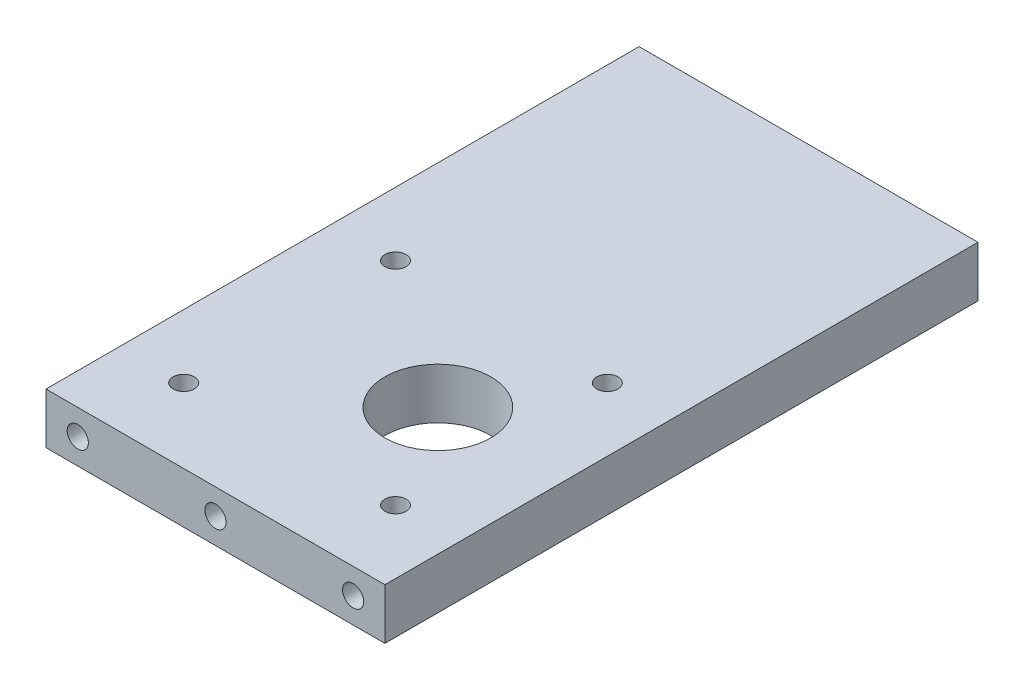
ISO-10303-21;
HEADER;
FILE_DESCRIPTION(('STEP AP214'),'2;1');
FILE_NAME('part.step','',(''),(''),'','','');
FILE_SCHEMA(('AUTOMOTIVE_DESIGN { 1 0 10303 214 1 1 1 1 }'));
ENDSEC;
DATA;
#1=APPLICATION_CONTEXT('core data for automotive mechanical design processes');
#2=APPLICATION_PROTOCOL_DEFINITION('international standard','automotive_design',2000,#1);
#3=PRODUCT_CONTEXT('',#1,'mechanical');
#4=PRODUCT('Part','Part','',(#3));
#5=PRODUCT_RELATED_PRODUCT_CATEGORY('part','',(#4));
#6=PRODUCT_DEFINITION_FORMATION('','',#4);
#7=PRODUCT_DEFINITION_CONTEXT('part definition',#1,'design');
#8=PRODUCT_DEFINITION('design','',#6,#7);
#9=PRODUCT_DEFINITION_SHAPE('','',#8);
#10=(LENGTH_UNIT() NAMED_UNIT(*) SI_UNIT(.MILLI.,.METRE.));
#11=(NAMED_UNIT(*) PLANE_ANGLE_UNIT() SI_UNIT($,.RADIAN.));
#12=(NAMED_UNIT(*) SI_UNIT($,.STERADIAN.) SOLID_ANGLE_UNIT());
#13=UNCERTAINTY_MEASURE_WITH_UNIT(LENGTH_MEASURE(1.E-05),#10,'distance_accuracy_value','');
#14=(GEOMETRIC_REPRESENTATION_CONTEXT(3) GLOBAL_UNCERTAINTY_ASSIGNED_CONTEXT((#13)) GLOBAL_UNIT_ASSIGNED_CONTEXT((#10,
#11,#12)) REPRESENTATION_CONTEXT('',''));
#15=CARTESIAN_POINT('',(0.,0.,0.));
#16=DIRECTION('',(0.,0.,1.));
#17=DIRECTION('',(1.,0.,0.));
#18=AXIS2_PLACEMENT_3D('',#15,#16,#17);
#19=CARTESIAN_POINT('',(0.,6.,0.));
#20=DIRECTION('',(0.,1.,0.));
#21=DIRECTION('',(0.,0.,1.));
#22=AXIS2_PLACEMENT_3D('',#19,#20,#21);
#23=PLANE('',#22);
#24=CARTESIAN_POINT('',(-25.,6.,-67.5));
#25=DIRECTION('',(0.,1.,0.));
#26=DIRECTION('',(0.,0.,1.));
#27=AXIS2_PLACEMENT_3D('',#24,#25,#26);
#28=CIRCLE('',#27,2.5);
#29=CARTESIAN_POINT('',(-25.,6.,-65.));
#30=VERTEX_POINT('',#29);
#31=EDGE_CURVE('E170',#30,#30,#28,.T.);
#32=ORIENTED_EDGE('',*,*,#31,.F.);
#33=EDGE_LOOP('',(#32));
#34=FACE_BOUND('',#33,.T.);
#35=CARTESIAN_POINT('',(25.,6.,-67.5));
#36=DIRECTION('',(0.,1.,0.));
#37=DIRECTION('',(0.,0.,1.));
#38=AXIS2_PLACEMENT_3D('',#35,#36,#37);
#39=CIRCLE('',#38,2.5);
#40=CARTESIAN_POINT('',(25.,6.,-65.));
#41=VERTEX_POINT('',#40);
#42=EDGE_CURVE('E176',#41,#41,#39,.T.);
#43=ORIENTED_EDGE('',*,*,#42,.F.);
#44=EDGE_LOOP('',(#43));
#45=FACE_BOUND('',#44,.T.);
#46=CARTESIAN_POINT('',(25.,6.,-17.5));
#47=DIRECTION('',(0.,1.,0.));
#48=DIRECTION('',(0.,0.,1.));
#49=AXIS2_PLACEMENT_3D('',#46,#47,#48);
#50=CIRCLE('',#49,2.5);
#51=CARTESIAN_POINT('',(25.,6.,-15.));
#52=VERTEX_POINT('',#51);
#53=EDGE_CURVE('E182',#52,#52,#50,.T.);
#54=ORIENTED_EDGE('',*,*,#53,.F.);
#55=EDGE_LOOP('',(#54));
#56=FACE_BOUND('',#55,.T.);
#57=CARTESIAN_POINT('',(-25.,6.,-17.5));
#58=DIRECTION('',(0.,1.,0.));
#59=DIRECTION('',(0.,0.,1.));
#60=AXIS2_PLACEMENT_3D('',#57,#58,#59);
#61=CIRCLE('',#60,2.5);
#62=CARTESIAN_POINT('',(-25.,6.,-15.));
#63=VERTEX_POINT('',#62);
#64=EDGE_CURVE('E188',#63,#63,#61,.T.);
#65=ORIENTED_EDGE('',*,*,#64,.F.);
#66=EDGE_LOOP('',(#65));
#67=FACE_BOUND('',#66,.T.);
#68=DIRECTION('',(0.,0.,1.));
#69=VECTOR('',#68,1.);
#70=CARTESIAN_POINT('',(-40.,6.,-140.));
#71=LINE('',#70,#69);
#72=CARTESIAN_POINT('',(-40.,6.,-140.));
#73=VERTEX_POINT('',#72);
#74=CARTESIAN_POINT('',(-40.,6.,0.));
#75=VERTEX_POINT('',#74);
#76=EDGE_CURVE('E201',#73,#75,#71,.T.);
#77=ORIENTED_EDGE('',*,*,#76,.T.);
#78=DIRECTION('',(1.,0.,0.));
#79=VECTOR('',#78,1.);
#80=CARTESIAN_POINT('',(-40.,6.,0.));
#81=LINE('',#80,#79);
#82=CARTESIAN_POINT('',(40.,6.,0.));
#83=VERTEX_POINT('',#82);
#84=EDGE_CURVE('E88',#75,#83,#81,.T.);
#85=ORIENTED_EDGE('',*,*,#84,.T.);
#86=DIRECTION('',(0.,0.,-1.));
#87=VECTOR('',#86,1.);
#88=CARTESIAN_POINT('',(40.,6.,-140.));
#89=LINE('',#88,#87);
#90=CARTESIAN_POINT('',(40.,6.,-140.));
#91=VERTEX_POINT('',#90);
#92=EDGE_CURVE('E204',#83,#91,#89,.T.);
#93=ORIENTED_EDGE('',*,*,#92,.T.);
#94=DIRECTION('',(-1.,0.,0.));
#95=VECTOR('',#94,1.);
#96=CARTESIAN_POINT('',(-40.,6.,-140.));
#97=LINE('',#96,#95);
#98=EDGE_CURVE('E57',#91,#73,#97,.T.);
#99=ORIENTED_EDGE('',*,*,#98,.T.);
#100=EDGE_LOOP('',(#77,#85,#93,#99));
#101=FACE_BOUND('',#100,.T.);
#102=CARTESIAN_POINT('',(10.,6.,-42.5));
#103=DIRECTION('',(0.,1.,0.));
#104=DIRECTION('',(0.,0.,1.));
#105=AXIS2_PLACEMENT_3D('',#102,#103,#104);
#106=CIRCLE('',#105,12.5);
#107=CARTESIAN_POINT('',(10.,6.,-30.));
#108=VERTEX_POINT('',#107);
#109=EDGE_CURVE('E195',#108,#108,#106,.T.);
#110=ORIENTED_EDGE('',*,*,#109,.F.);
#111=EDGE_LOOP('',(#110));
#112=FACE_BOUND('',#111,.T.);
#113=ADVANCED_FACE('F40',(#34,#45,#56,#67,#101,#112),#23,.T.);
#114=CARTESIAN_POINT('',(0.,-6.,0.));
#115=DIRECTION('',(0.,1.,0.));
#116=DIRECTION('',(0.,0.,1.));
#117=AXIS2_PLACEMENT_3D('',#114,#115,#116);
#118=PLANE('',#117);
#119=CARTESIAN_POINT('',(-25.,-6.,-67.5));
#120=DIRECTION('',(0.,1.,0.));
#121=DIRECTION('',(0.,0.,1.));
#122=AXIS2_PLACEMENT_3D('',#119,#120,#121);
#123=CIRCLE('',#122,2.5);
#124=CARTESIAN_POINT('',(-25.,-6.,-65.));
#125=VERTEX_POINT('',#124);
#126=EDGE_CURVE('E173',#125,#125,#123,.T.);
#127=ORIENTED_EDGE('',*,*,#126,.T.);
#128=EDGE_LOOP('',(#127));
#129=FACE_BOUND('',#128,.T.);
#130=CARTESIAN_POINT('',(25.,-6.,-67.5));
#131=DIRECTION('',(0.,1.,0.));
#132=DIRECTION('',(0.,0.,1.));
#133=AXIS2_PLACEMENT_3D('',#130,#131,#132);
#134=CIRCLE('',#133,2.5);
#135=CARTESIAN_POINT('',(25.,-6.,-65.));
#136=VERTEX_POINT('',#135);
#137=EDGE_CURVE('E179',#136,#136,#134,.T.);
#138=ORIENTED_EDGE('',*,*,#137,.T.);
#139=EDGE_LOOP('',(#138));
#140=FACE_BOUND('',#139,.T.);
#141=CARTESIAN_POINT('',(25.,-6.,-17.5));
#142=DIRECTION('',(0.,1.,0.));
#143=DIRECTION('',(0.,0.,1.));
#144=AXIS2_PLACEMENT_3D('',#141,#142,#143);
#145=CIRCLE('',#144,2.5);
#146=CARTESIAN_POINT('',(25.,-6.,-15.));
#147=VERTEX_POINT('',#146);
#148=EDGE_CURVE('E185',#147,#147,#145,.T.);
#149=ORIENTED_EDGE('',*,*,#148,.T.);
#150=EDGE_LOOP('',(#149));
#151=FACE_BOUND('',#150,.T.);
#152=CARTESIAN_POINT('',(-25.,-6.,-17.5));
#153=DIRECTION('',(0.,1.,0.));
#154=DIRECTION('',(0.,0.,1.));
#155=AXIS2_PLACEMENT_3D('',#152,#153,#154);
#156=CIRCLE('',#155,2.5);
#157=CARTESIAN_POINT('',(-25.,-6.,-15.));
#158=VERTEX_POINT('',#157);
#159=EDGE_CURVE('E191',#158,#158,#156,.T.);
#160=ORIENTED_EDGE('',*,*,#159,.T.);
#161=EDGE_LOOP('',(#160));
#162=FACE_BOUND('',#161,.T.);
#163=DIRECTION('',(0.,0.,1.));
#164=VECTOR('',#163,1.);
#165=CARTESIAN_POINT('',(-40.,-6.,-140.));
#166=LINE('',#165,#164);
#167=CARTESIAN_POINT('',(-40.,-6.,-140.));
#168=VERTEX_POINT('',#167);
#169=CARTESIAN_POINT('',(-40.,-6.,0.));
#170=VERTEX_POINT('',#169);
#171=EDGE_CURVE('E198',#168,#170,#166,.T.);
#172=ORIENTED_EDGE('',*,*,#171,.F.);
#173=DIRECTION('',(-1.,0.,0.));
#174=VECTOR('',#173,1.);
#175=CARTESIAN_POINT('',(-40.,-6.,-140.));
#176=LINE('',#175,#174);
#177=CARTESIAN_POINT('',(40.,-6.,-140.));
#178=VERTEX_POINT('',#177);
#179=EDGE_CURVE('E81',#178,#168,#176,.T.);
#180=ORIENTED_EDGE('',*,*,#179,.F.);
#181=DIRECTION('',(0.,0.,-1.));
#182=VECTOR('',#181,1.);
#183=CARTESIAN_POINT('',(40.,-6.,-140.));
#184=LINE('',#183,#182);
#185=CARTESIAN_POINT('',(40.,-6.,0.));
#186=VERTEX_POINT('',#185);
#187=EDGE_CURVE('E75',#186,#178,#184,.T.);
#188=ORIENTED_EDGE('',*,*,#187,.F.);
#189=DIRECTION('',(1.,0.,0.));
#190=VECTOR('',#189,1.);
#191=CARTESIAN_POINT('',(-40.,-6.,0.));
#192=LINE('',#191,#190);
#193=EDGE_CURVE('E210',#170,#186,#192,.T.);
#194=ORIENTED_EDGE('',*,*,#193,.F.);
#195=EDGE_LOOP('',(#172,#180,#188,#194));
#196=FACE_BOUND('',#195,.T.);
#197=CARTESIAN_POINT('',(10.,-6.,-42.5));
#198=DIRECTION('',(0.,1.,0.));
#199=DIRECTION('',(0.,0.,1.));
#200=AXIS2_PLACEMENT_3D('',#197,#198,#199);
#201=CIRCLE('',#200,12.5);
#202=CARTESIAN_POINT('',(10.,-6.,-30.));
#203=VERTEX_POINT('',#202);
#204=EDGE_CURVE('E194',#203,#203,#201,.T.);
#205=ORIENTED_EDGE('',*,*,#204,.T.);
#206=EDGE_LOOP('',(#205));
#207=FACE_BOUND('',#206,.T.);
#208=ADVANCED_FACE('F220',(#129,#140,#151,#162,#196,#207),#118,.F.);
#209=CARTESIAN_POINT('',(-40.,6.,-140.));
#210=DIRECTION('',(1.,0.,0.));
#211=DIRECTION('',(0.,0.,-1.));
#212=AXIS2_PLACEMENT_3D('',#209,#210,#211);
#213=PLANE('',#212);
#214=CARTESIAN_POINT('',(-40.,0.,-113.));
#215=DIRECTION('',(-1.,0.,0.));
#216=DIRECTION('',(0.,0.,1.));
#217=AXIS2_PLACEMENT_3D('',#214,#215,#216);
#218=CIRCLE('',#217,3.49999999999999);
#219=CARTESIAN_POINT('',(-40.,0.,-109.5));
#220=VERTEX_POINT('',#219);
#221=EDGE_CURVE('E124',#220,#220,#218,.T.);
#222=ORIENTED_EDGE('',*,*,#221,.F.);
#223=EDGE_LOOP('',(#222));
#224=FACE_BOUND('',#223,.T.);
#225=CARTESIAN_POINT('',(-40.,0.,-86.));
#226=DIRECTION('',(-1.,0.,0.));
#227=DIRECTION('',(0.,0.,1.));
#228=AXIS2_PLACEMENT_3D('',#225,#226,#227);
#229=CIRCLE('',#228,3.49999999999999);
#230=CARTESIAN_POINT('',(-40.,0.,-82.5));
#231=VERTEX_POINT('',#230);
#232=EDGE_CURVE('E123',#231,#231,#229,.T.);
#233=ORIENTED_EDGE('',*,*,#232,.F.);
#234=EDGE_LOOP('',(#233));
#235=FACE_BOUND('',#234,.T.);
#236=ORIENTED_EDGE('',*,*,#171,.T.);
#237=DIRECTION('',(0.,-1.,0.));
#238=VECTOR('',#237,1.);
#239=CARTESIAN_POINT('',(-40.,6.,0.));
#240=LINE('',#239,#238);
#241=EDGE_CURVE('E11',#75,#170,#240,.T.);
#242=ORIENTED_EDGE('',*,*,#241,.F.);
#243=ORIENTED_EDGE('',*,*,#76,.F.);
#244=DIRECTION('',(0.,-1.,0.));
#245=VECTOR('',#244,1.);
#246=CARTESIAN_POINT('',(-40.,6.,-140.));
#247=LINE('',#246,#245);
#248=EDGE_CURVE('E207',#73,#168,#247,.T.);
#249=ORIENTED_EDGE('',*,*,#248,.T.);
#250=EDGE_LOOP('',(#236,#242,#243,#249));
#251=FACE_BOUND('',#250,.T.);
#252=ADVANCED_FACE('F42',(#224,#235,#251),#213,.F.);
#253=CARTESIAN_POINT('',(-40.,6.,0.));
#254=DIRECTION('',(0.,0.,-1.));
#255=DIRECTION('',(-1.,0.,0.));
#256=AXIS2_PLACEMENT_3D('',#253,#254,#255);
#257=PLANE('',#256);
#258=CARTESIAN_POINT('',(32.5,0.,0.));
#259=DIRECTION('',(0.,0.,1.));
#260=DIRECTION('',(1.,0.,0.));
#261=AXIS2_PLACEMENT_3D('',#258,#259,#260);
#262=CIRCLE('',#261,2.49999999999999);
#263=CARTESIAN_POINT('',(35.,0.,0.));
#264=VERTEX_POINT('',#263);
#265=EDGE_CURVE('E152',#264,#264,#262,.T.);
#266=ORIENTED_EDGE('',*,*,#265,.F.);
#267=EDGE_LOOP('',(#266));
#268=FACE_BOUND('',#267,.T.);
#269=CARTESIAN_POINT('',(0.,0.,0.));
#270=DIRECTION('',(0.,0.,1.));
#271=DIRECTION('',(1.,0.,0.));
#272=AXIS2_PLACEMENT_3D('',#269,#270,#271);
#273=CIRCLE('',#272,2.49999999999999);
#274=CARTESIAN_POINT('',(2.49999999999999,0.,0.));
#275=VERTEX_POINT('',#274);
#276=EDGE_CURVE('E158',#275,#275,#273,.T.);
#277=ORIENTED_EDGE('',*,*,#276,.F.);
#278=EDGE_LOOP('',(#277));
#279=FACE_BOUND('',#278,.T.);
#280=CARTESIAN_POINT('',(-32.5,0.,0.));
#281=DIRECTION('',(0.,0.,1.));
#282=DIRECTION('',(1.,0.,0.));
#283=AXIS2_PLACEMENT_3D('',#280,#281,#282);
#284=CIRCLE('',#283,2.49999999999999);
#285=CARTESIAN_POINT('',(-30.,0.,0.));
#286=VERTEX_POINT('',#285);
#287=EDGE_CURVE('E164',#286,#286,#284,.T.);
#288=ORIENTED_EDGE('',*,*,#287,.F.);
#289=EDGE_LOOP('',(#288));
#290=FACE_BOUND('',#289,.T.);
#291=ORIENTED_EDGE('',*,*,#193,.T.);
#292=DIRECTION('',(0.,-1.,0.));
#293=VECTOR('',#292,1.);
#294=CARTESIAN_POINT('',(40.,6.,0.));
#295=LINE('',#294,#293);
#296=EDGE_CURVE('E49',#83,#186,#295,.T.);
#297=ORIENTED_EDGE('',*,*,#296,.F.);
#298=ORIENTED_EDGE('',*,*,#84,.F.);
#299=ORIENTED_EDGE('',*,*,#241,.T.);
#300=EDGE_LOOP('',(#291,#297,#298,#299));
#301=FACE_BOUND('',#300,.T.);
#302=ADVANCED_FACE('F237',(#268,#279,#290,#301),#257,.F.);
#303=CARTESIAN_POINT('',(40.,6.,-140.));
#304=DIRECTION('',(-1.,0.,0.));
#305=DIRECTION('',(0.,0.,1.));
#306=AXIS2_PLACEMENT_3D('',#303,#304,#305);
#307=PLANE('',#306);
#308=ORIENTED_EDGE('',*,*,#187,.T.);
#309=DIRECTION('',(0.,-1.,0.));
#310=VECTOR('',#309,1.);
#311=CARTESIAN_POINT('',(40.,6.,-140.));
#312=LINE('',#311,#310);
#313=EDGE_CURVE('E215',#91,#178,#312,.T.);
#314=ORIENTED_EDGE('',*,*,#313,.F.);
#315=ORIENTED_EDGE('',*,*,#92,.F.);
#316=ORIENTED_EDGE('',*,*,#296,.T.);
#317=EDGE_LOOP('',(#308,#314,#315,#316));
#318=FACE_BOUND('',#317,.T.);
#319=ADVANCED_FACE('F217',(#318),#307,.F.);
#320=CARTESIAN_POINT('',(-40.,6.,-140.));
#321=DIRECTION('',(0.,0.,1.));
#322=DIRECTION('',(1.,0.,0.));
#323=AXIS2_PLACEMENT_3D('',#320,#321,#322);
#324=PLANE('',#323);
#325=CARTESIAN_POINT('',(32.5,0.,-140.));
#326=DIRECTION('',(0.,0.,-1.));
#327=DIRECTION('',(-1.,0.,0.));
#328=AXIS2_PLACEMENT_3D('',#325,#326,#327);
#329=CIRCLE('',#328,2.49999999999999);
#330=CARTESIAN_POINT('',(30.,0.,-140.));
#331=VERTEX_POINT('',#330);
#332=EDGE_CURVE('E134',#331,#331,#329,.T.);
#333=ORIENTED_EDGE('',*,*,#332,.F.);
#334=EDGE_LOOP('',(#333));
#335=FACE_BOUND('',#334,.T.);
#336=CARTESIAN_POINT('',(0.,0.,-140.));
#337=DIRECTION('',(0.,0.,-1.));
#338=DIRECTION('',(-1.,0.,0.));
#339=AXIS2_PLACEMENT_3D('',#336,#337,#338);
#340=CIRCLE('',#339,2.49999999999999);
#341=CARTESIAN_POINT('',(-2.49999999999999,0.,-140.));
#342=VERTEX_POINT('',#341);
#343=EDGE_CURVE('E140',#342,#342,#340,.T.);
#344=ORIENTED_EDGE('',*,*,#343,.F.);
#345=EDGE_LOOP('',(#344));
#346=FACE_BOUND('',#345,.T.);
#347=CARTESIAN_POINT('',(-32.5,0.,-140.));
#348=DIRECTION('',(0.,0.,-1.));
#349=DIRECTION('',(-1.,0.,0.));
#350=AXIS2_PLACEMENT_3D('',#347,#348,#349);
#351=CIRCLE('',#350,2.49999999999999);
#352=CARTESIAN_POINT('',(-35.,0.,-140.));
#353=VERTEX_POINT('',#352);
#354=EDGE_CURVE('E146',#353,#353,#351,.T.);
#355=ORIENTED_EDGE('',*,*,#354,.F.);
#356=EDGE_LOOP('',(#355));
#357=FACE_BOUND('',#356,.T.);
#358=ORIENTED_EDGE('',*,*,#179,.T.);
#359=ORIENTED_EDGE('',*,*,#248,.F.);
#360=ORIENTED_EDGE('',*,*,#98,.F.);
#361=ORIENTED_EDGE('',*,*,#313,.T.);
#362=EDGE_LOOP('',(#358,#359,#360,#361));
#363=FACE_BOUND('',#362,.T.);
#364=ADVANCED_FACE('F225',(#335,#346,#357,#363),#324,.F.);
#365=CARTESIAN_POINT('',(10.,6.,-42.5));
#366=DIRECTION('',(0.,-1.,0.));
#367=DIRECTION('',(0.,0.,-1.));
#368=AXIS2_PLACEMENT_3D('',#365,#366,#367);
#369=CYLINDRICAL_SURFACE('',#368,12.5);
#370=ORIENTED_EDGE('',*,*,#109,.T.);
#371=EDGE_LOOP('',(#370));
#372=FACE_BOUND('',#371,.T.);
#373=ORIENTED_EDGE('',*,*,#204,.F.);
#374=EDGE_LOOP('',(#373));
#375=FACE_BOUND('',#374,.T.);
#376=ADVANCED_FACE('F227',(#372,#375),#369,.F.);
#377=CARTESIAN_POINT('',(-25.,6.,-17.5));
#378=DIRECTION('',(0.,1.,0.));
#379=DIRECTION('',(0.,0.,1.));
#380=AXIS2_PLACEMENT_3D('',#377,#378,#379);
#381=CYLINDRICAL_SURFACE('',#380,2.5);
#382=ORIENTED_EDGE('',*,*,#159,.F.);
#383=EDGE_LOOP('',(#382));
#384=FACE_BOUND('',#383,.T.);
#385=ORIENTED_EDGE('',*,*,#64,.T.);
#386=EDGE_LOOP('',(#385));
#387=FACE_BOUND('',#386,.T.);
#388=ADVANCED_FACE('F234',(#384,#387),#381,.F.);
#389=CARTESIAN_POINT('',(25.,6.,-17.5));
#390=DIRECTION('',(0.,1.,0.));
#391=DIRECTION('',(0.,0.,1.));
#392=AXIS2_PLACEMENT_3D('',#389,#390,#391);
#393=CYLINDRICAL_SURFACE('',#392,2.5);
#394=ORIENTED_EDGE('',*,*,#148,.F.);
#395=EDGE_LOOP('',(#394));
#396=FACE_BOUND('',#395,.T.);
#397=ORIENTED_EDGE('',*,*,#53,.T.);
#398=EDGE_LOOP('',(#397));
#399=FACE_BOUND('',#398,.T.);
#400=ADVANCED_FACE('F254',(#396,#399),#393,.F.);
#401=CARTESIAN_POINT('',(25.,6.,-67.5));
#402=DIRECTION('',(0.,1.,0.));
#403=DIRECTION('',(0.,0.,1.));
#404=AXIS2_PLACEMENT_3D('',#401,#402,#403);
#405=CYLINDRICAL_SURFACE('',#404,2.5);
#406=ORIENTED_EDGE('',*,*,#137,.F.);
#407=EDGE_LOOP('',(#406));
#408=FACE_BOUND('',#407,.T.);
#409=ORIENTED_EDGE('',*,*,#42,.T.);
#410=EDGE_LOOP('',(#409));
#411=FACE_BOUND('',#410,.T.);
#412=ADVANCED_FACE('F258',(#408,#411),#405,.F.);
#413=CARTESIAN_POINT('',(-25.,6.,-67.5));
#414=DIRECTION('',(0.,1.,0.));
#415=DIRECTION('',(0.,0.,1.));
#416=AXIS2_PLACEMENT_3D('',#413,#414,#415);
#417=CYLINDRICAL_SURFACE('',#416,2.5);
#418=ORIENTED_EDGE('',*,*,#126,.F.);
#419=EDGE_LOOP('',(#418));
#420=FACE_BOUND('',#419,.T.);
#421=ORIENTED_EDGE('',*,*,#31,.T.);
#422=EDGE_LOOP('',(#421));
#423=FACE_BOUND('',#422,.T.);
#424=ADVANCED_FACE('F262',(#420,#423),#417,.F.);
#425=CARTESIAN_POINT('',(-32.5,0.,-13.));
#426=DIRECTION('',(0.,0.,1.));
#427=DIRECTION('',(1.,0.,0.));
#428=AXIS2_PLACEMENT_3D('',#425,#426,#427);
#429=CONICAL_SURFACE('',#428,2.5,1.02974425867665);
#430=CARTESIAN_POINT('',(-32.5,0.,-14.5021515475689));
#431=VERTEX_POINT('',#430);
#432=VERTEX_LOOP('',#431);
#433=FACE_BOUND('',#432,.T.);
#434=CARTESIAN_POINT('',(-32.5,0.,-13.));
#435=DIRECTION('',(0.,0.,1.));
#436=DIRECTION('',(1.,0.,0.));
#437=AXIS2_PLACEMENT_3D('',#434,#435,#436);
#438=CIRCLE('',#437,2.5);
#439=CARTESIAN_POINT('',(-30.,0.,-13.));
#440=VERTEX_POINT('',#439);
#441=EDGE_CURVE('E167',#440,#440,#438,.T.);
#442=ORIENTED_EDGE('',*,*,#441,.T.);
#443=EDGE_LOOP('',(#442));
#444=FACE_BOUND('',#443,.T.);
#445=ADVANCED_FACE('F266',(#433,#444),#429,.F.);
#446=CARTESIAN_POINT('',(-32.5,0.,0.));
#447=DIRECTION('',(0.,0.,1.));
#448=DIRECTION('',(1.,0.,0.));
#449=AXIS2_PLACEMENT_3D('',#446,#447,#448);
#450=CYLINDRICAL_SURFACE('',#449,2.49999999999999);
#451=ORIENTED_EDGE('',*,*,#441,.F.);
#452=EDGE_LOOP('',(#451));
#453=FACE_BOUND('',#452,.T.);
#454=ORIENTED_EDGE('',*,*,#287,.T.);
#455=EDGE_LOOP('',(#454));
#456=FACE_BOUND('',#455,.T.);
#457=ADVANCED_FACE('F270',(#453,#456),#450,.F.);
#458=CARTESIAN_POINT('',(0.,0.,-13.));
#459=DIRECTION('',(0.,0.,1.));
#460=DIRECTION('',(1.,0.,0.));
#461=AXIS2_PLACEMENT_3D('',#458,#459,#460);
#462=CONICAL_SURFACE('',#461,2.5,1.02974425867665);
#463=CARTESIAN_POINT('',(0.,0.,-14.5021515475689));
#464=VERTEX_POINT('',#463);
#465=VERTEX_LOOP('',#464);
#466=FACE_BOUND('',#465,.T.);
#467=CARTESIAN_POINT('',(0.,0.,-13.));
#468=DIRECTION('',(0.,0.,1.));
#469=DIRECTION('',(1.,0.,0.));
#470=AXIS2_PLACEMENT_3D('',#467,#468,#469);
#471=CIRCLE('',#470,2.5);
#472=CARTESIAN_POINT('',(2.5,0.,-13.));
#473=VERTEX_POINT('',#472);
#474=EDGE_CURVE('E161',#473,#473,#471,.T.);
#475=ORIENTED_EDGE('',*,*,#474,.T.);
#476=EDGE_LOOP('',(#475));
#477=FACE_BOUND('',#476,.T.);
#478=ADVANCED_FACE('F274',(#466,#477),#462,.F.);
#479=CARTESIAN_POINT('',(0.,0.,0.));
#480=DIRECTION('',(0.,0.,1.));
#481=DIRECTION('',(1.,0.,0.));
#482=AXIS2_PLACEMENT_3D('',#479,#480,#481);
#483=CYLINDRICAL_SURFACE('',#482,2.49999999999999);
#484=ORIENTED_EDGE('',*,*,#474,.F.);
#485=EDGE_LOOP('',(#484));
#486=FACE_BOUND('',#485,.T.);
#487=ORIENTED_EDGE('',*,*,#276,.T.);
#488=EDGE_LOOP('',(#487));
#489=FACE_BOUND('',#488,.T.);
#490=ADVANCED_FACE('F278',(#486,#489),#483,.F.);
#491=CARTESIAN_POINT('',(32.5,0.,-13.));
#492=DIRECTION('',(0.,0.,1.));
#493=DIRECTION('',(1.,0.,0.));
#494=AXIS2_PLACEMENT_3D('',#491,#492,#493);
#495=CONICAL_SURFACE('',#494,2.5,1.02974425867665);
#496=CARTESIAN_POINT('',(32.5,0.,-14.5021515475689));
#497=VERTEX_POINT('',#496);
#498=VERTEX_LOOP('',#497);
#499=FACE_BOUND('',#498,.T.);
#500=CARTESIAN_POINT('',(32.5,0.,-13.));
#501=DIRECTION('',(0.,0.,1.));
#502=DIRECTION('',(1.,0.,0.));
#503=AXIS2_PLACEMENT_3D('',#500,#501,#502);
#504=CIRCLE('',#503,2.5);
#505=CARTESIAN_POINT('',(35.,0.,-13.));
#506=VERTEX_POINT('',#505);
#507=EDGE_CURVE('E155',#506,#506,#504,.T.);
#508=ORIENTED_EDGE('',*,*,#507,.T.);
#509=EDGE_LOOP('',(#508));
#510=FACE_BOUND('',#509,.T.);
#511=ADVANCED_FACE('F282',(#499,#510),#495,.F.);
#512=CARTESIAN_POINT('',(32.5,0.,0.));
#513=DIRECTION('',(0.,0.,1.));
#514=DIRECTION('',(1.,0.,0.));
#515=AXIS2_PLACEMENT_3D('',#512,#513,#514);
#516=CYLINDRICAL_SURFACE('',#515,2.49999999999999);
#517=ORIENTED_EDGE('',*,*,#507,.F.);
#518=EDGE_LOOP('',(#517));
#519=FACE_BOUND('',#518,.T.);
#520=ORIENTED_EDGE('',*,*,#265,.T.);
#521=EDGE_LOOP('',(#520));
#522=FACE_BOUND('',#521,.T.);
#523=ADVANCED_FACE('F286',(#519,#522),#516,.F.);
#524=CARTESIAN_POINT('',(-32.5,0.,-127.));
#525=DIRECTION('',(0.,0.,-1.));
#526=DIRECTION('',(-1.,0.,0.));
#527=AXIS2_PLACEMENT_3D('',#524,#525,#526);
#528=CONICAL_SURFACE('',#527,2.5,1.02974425867666);
#529=CARTESIAN_POINT('',(-32.5,0.,-125.497848452431));
#530=VERTEX_POINT('',#529);
#531=VERTEX_LOOP('',#530);
#532=FACE_BOUND('',#531,.T.);
#533=CARTESIAN_POINT('',(-32.5,0.,-127.));
#534=DIRECTION('',(0.,0.,-1.));
#535=DIRECTION('',(-1.,0.,0.));
#536=AXIS2_PLACEMENT_3D('',#533,#534,#535);
#537=CIRCLE('',#536,2.5);
#538=CARTESIAN_POINT('',(-35.,0.,-127.));
#539=VERTEX_POINT('',#538);
#540=EDGE_CURVE('E149',#539,#539,#537,.T.);
#541=ORIENTED_EDGE('',*,*,#540,.T.);
#542=EDGE_LOOP('',(#541));
#543=FACE_BOUND('',#542,.T.);
#544=ADVANCED_FACE('F290',(#532,#543),#528,.F.);
#545=CARTESIAN_POINT('',(-32.5,0.,-140.));
#546=DIRECTION('',(0.,0.,-1.));
#547=DIRECTION('',(-1.,0.,0.));
#548=AXIS2_PLACEMENT_3D('',#545,#546,#547);
#549=CYLINDRICAL_SURFACE('',#548,2.49999999999999);
#550=ORIENTED_EDGE('',*,*,#540,.F.);
#551=EDGE_LOOP('',(#550));
#552=FACE_BOUND('',#551,.T.);
#553=ORIENTED_EDGE('',*,*,#354,.T.);
#554=EDGE_LOOP('',(#553));
#555=FACE_BOUND('',#554,.T.);
#556=ADVANCED_FACE('F294',(#552,#555),#549,.F.);
#557=CARTESIAN_POINT('',(0.,0.,-127.));
#558=DIRECTION('',(0.,0.,-1.));
#559=DIRECTION('',(-1.,0.,0.));
#560=AXIS2_PLACEMENT_3D('',#557,#558,#559);
#561=CONICAL_SURFACE('',#560,2.5,1.02974425867666);
#562=CARTESIAN_POINT('',(0.,0.,-125.497848452431));
#563=VERTEX_POINT('',#562);
#564=VERTEX_LOOP('',#563);
#565=FACE_BOUND('',#564,.T.);
#566=CARTESIAN_POINT('',(0.,0.,-127.));
#567=DIRECTION('',(0.,0.,-1.));
#568=DIRECTION('',(-1.,0.,0.));
#569=AXIS2_PLACEMENT_3D('',#566,#567,#568);
#570=CIRCLE('',#569,2.5);
#571=CARTESIAN_POINT('',(-2.5,0.,-127.));
#572=VERTEX_POINT('',#571);
#573=EDGE_CURVE('E143',#572,#572,#570,.T.);
#574=ORIENTED_EDGE('',*,*,#573,.T.);
#575=EDGE_LOOP('',(#574));
#576=FACE_BOUND('',#575,.T.);
#577=ADVANCED_FACE('F298',(#565,#576),#561,.F.);
#578=CARTESIAN_POINT('',(0.,0.,-140.));
#579=DIRECTION('',(0.,0.,-1.));
#580=DIRECTION('',(-1.,0.,0.));
#581=AXIS2_PLACEMENT_3D('',#578,#579,#580);
#582=CYLINDRICAL_SURFACE('',#581,2.49999999999999);
#583=ORIENTED_EDGE('',*,*,#573,.F.);
#584=EDGE_LOOP('',(#583));
#585=FACE_BOUND('',#584,.T.);
#586=ORIENTED_EDGE('',*,*,#343,.T.);
#587=EDGE_LOOP('',(#586));
#588=FACE_BOUND('',#587,.T.);
#589=ADVANCED_FACE('F302',(#585,#588),#582,.F.);
#590=CARTESIAN_POINT('',(32.5,0.,-127.));
#591=DIRECTION('',(0.,0.,-1.));
#592=DIRECTION('',(-1.,0.,0.));
#593=AXIS2_PLACEMENT_3D('',#590,#591,#592);
#594=CONICAL_SURFACE('',#593,2.5,1.02974425867666);
#595=CARTESIAN_POINT('',(32.5,0.,-125.497848452431));
#596=VERTEX_POINT('',#595);
#597=VERTEX_LOOP('',#596);
#598=FACE_BOUND('',#597,.T.);
#599=CARTESIAN_POINT('',(32.5,0.,-127.));
#600=DIRECTION('',(0.,0.,-1.));
#601=DIRECTION('',(-1.,0.,0.));
#602=AXIS2_PLACEMENT_3D('',#599,#600,#601);
#603=CIRCLE('',#602,2.5);
#604=CARTESIAN_POINT('',(30.,0.,-127.));
#605=VERTEX_POINT('',#604);
#606=EDGE_CURVE('E137',#605,#605,#603,.T.);
#607=ORIENTED_EDGE('',*,*,#606,.T.);
#608=EDGE_LOOP('',(#607));
#609=FACE_BOUND('',#608,.T.);
#610=ADVANCED_FACE('F306',(#598,#609),#594,.F.);
#611=CARTESIAN_POINT('',(32.5,0.,-140.));
#612=DIRECTION('',(0.,0.,-1.));
#613=DIRECTION('',(-1.,0.,0.));
#614=AXIS2_PLACEMENT_3D('',#611,#612,#613);
#615=CYLINDRICAL_SURFACE('',#614,2.49999999999999);
#616=ORIENTED_EDGE('',*,*,#606,.F.);
#617=EDGE_LOOP('',(#616));
#618=FACE_BOUND('',#617,.T.);
#619=ORIENTED_EDGE('',*,*,#332,.T.);
#620=EDGE_LOOP('',(#619));
#621=FACE_BOUND('',#620,.T.);
#622=ADVANCED_FACE('F310',(#618,#621),#615,.F.);
#623=CARTESIAN_POINT('',(-21.,0.,-86.));
#624=DIRECTION('',(-1.,0.,0.));
#625=DIRECTION('',(0.,0.,1.));
#626=AXIS2_PLACEMENT_3D('',#623,#624,#625);
#627=CONICAL_SURFACE('',#626,3.49999999999999,1.02974425867665);
#628=CARTESIAN_POINT('',(-18.8969878334035,0.,-86.));
#629=VERTEX_POINT('',#628);
#630=VERTEX_LOOP('',#629);
#631=FACE_BOUND('',#630,.T.);
#632=CARTESIAN_POINT('',(-21.,0.,-86.));
#633=DIRECTION('',(-1.,0.,0.));
#634=DIRECTION('',(0.,0.,1.));
#635=AXIS2_PLACEMENT_3D('',#632,#633,#634);
#636=CIRCLE('',#635,3.49999999999999);
#637=CARTESIAN_POINT('',(-21.,0.,-82.5));
#638=VERTEX_POINT('',#637);
#639=EDGE_CURVE('E127',#638,#638,#636,.T.);
#640=ORIENTED_EDGE('',*,*,#639,.T.);
#641=EDGE_LOOP('',(#640));
#642=FACE_BOUND('',#641,.T.);
#643=ADVANCED_FACE('F314',(#631,#642),#627,.F.);
#644=CARTESIAN_POINT('',(-40.,0.,-86.));
#645=DIRECTION('',(-1.,0.,0.));
#646=DIRECTION('',(0.,0.,1.));
#647=AXIS2_PLACEMENT_3D('',#644,#645,#646);
#648=CYLINDRICAL_SURFACE('',#647,3.49999999999999);
#649=ORIENTED_EDGE('',*,*,#639,.F.);
#650=EDGE_LOOP('',(#649));
#651=FACE_BOUND('',#650,.T.);
#652=ORIENTED_EDGE('',*,*,#232,.T.);
#653=EDGE_LOOP('',(#652));
#654=FACE_BOUND('',#653,.T.);
#655=ADVANCED_FACE('F117',(#651,#654),#648,.F.);
#656=CARTESIAN_POINT('',(-21.,0.,-113.));
#657=DIRECTION('',(-1.,0.,0.));
#658=DIRECTION('',(0.,0.,1.));
#659=AXIS2_PLACEMENT_3D('',#656,#657,#658);
#660=CONICAL_SURFACE('',#659,3.49999999999999,1.02974425867665);
#661=CARTESIAN_POINT('',(-18.8969878334035,0.,-113.));
#662=VERTEX_POINT('',#661);
#663=VERTEX_LOOP('',#662);
#664=FACE_BOUND('',#663,.T.);
#665=CARTESIAN_POINT('',(-21.,0.,-113.));
#666=DIRECTION('',(-1.,0.,0.));
#667=DIRECTION('',(0.,0.,1.));
#668=AXIS2_PLACEMENT_3D('',#665,#666,#667);
#669=CIRCLE('',#668,3.49999999999999);
#670=CARTESIAN_POINT('',(-21.,0.,-109.5));
#671=VERTEX_POINT('',#670);
#672=EDGE_CURVE('E121',#671,#671,#669,.T.);
#673=ORIENTED_EDGE('',*,*,#672,.T.);
#674=EDGE_LOOP('',(#673));
#675=FACE_BOUND('',#674,.T.);
#676=ADVANCED_FACE('F113',(#664,#675),#660,.F.);
#677=CARTESIAN_POINT('',(-40.,0.,-113.));
#678=DIRECTION('',(-1.,0.,0.));
#679=DIRECTION('',(0.,0.,1.));
#680=AXIS2_PLACEMENT_3D('',#677,#678,#679);
#681=CYLINDRICAL_SURFACE('',#680,3.49999999999999);
#682=ORIENTED_EDGE('',*,*,#672,.F.);
#683=EDGE_LOOP('',(#682));
#684=FACE_BOUND('',#683,.T.);
#685=ORIENTED_EDGE('',*,*,#221,.T.);
#686=EDGE_LOOP('',(#685));
#687=FACE_BOUND('',#686,.T.);
#688=ADVANCED_FACE('F116',(#684,#687),#681,.F.);
#689=CLOSED_SHELL('',(#113,#208,#252,#302,#319,#364,#376,#388,#400,#412,#424,#445,#457,#478,
#490,#511,#523,#544,#556,#577,#589,#610,#622,#643,#655,#676,#688));
#690=MANIFOLD_SOLID_BREP('B2',#689);
#691=ADVANCED_BREP_SHAPE_REPRESENTATION('',(#18,#690),#14);
#692=SHAPE_DEFINITION_REPRESENTATION(#9,#691);
ENDSEC;
END-ISO-10303-21;
